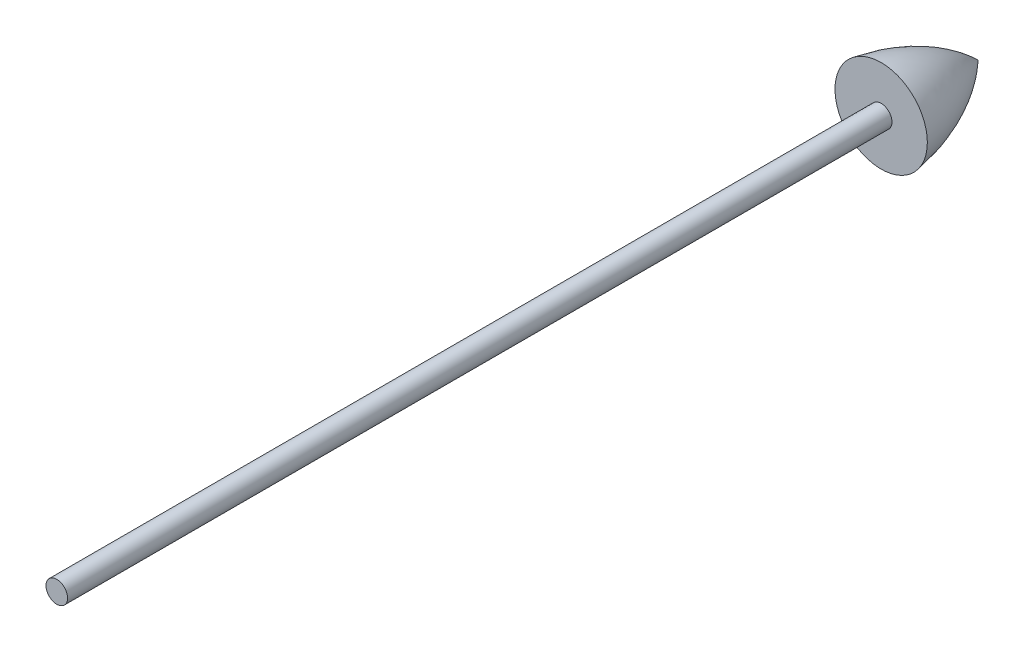
ISO-10303-21;
HEADER;
FILE_DESCRIPTION(('STEP AP214'),'2;1');
FILE_NAME('part.step','',(''),(''),'','','');
FILE_SCHEMA(('AUTOMOTIVE_DESIGN { 1 0 10303 214 1 1 1 1 }'));
ENDSEC;
DATA;
#1=APPLICATION_CONTEXT('core data for automotive mechanical design processes');
#2=APPLICATION_PROTOCOL_DEFINITION('international standard','automotive_design',2000,#1);
#3=PRODUCT_CONTEXT('',#1,'mechanical');
#4=PRODUCT('Part','Part','',(#3));
#5=PRODUCT_RELATED_PRODUCT_CATEGORY('part','',(#4));
#6=PRODUCT_DEFINITION_FORMATION('','',#4);
#7=PRODUCT_DEFINITION_CONTEXT('part definition',#1,'design');
#8=PRODUCT_DEFINITION('design','',#6,#7);
#9=PRODUCT_DEFINITION_SHAPE('','',#8);
#10=(LENGTH_UNIT() NAMED_UNIT(*) SI_UNIT(.MILLI.,.METRE.));
#11=(NAMED_UNIT(*) PLANE_ANGLE_UNIT() SI_UNIT($,.RADIAN.));
#12=(NAMED_UNIT(*) SI_UNIT($,.STERADIAN.) SOLID_ANGLE_UNIT());
#13=UNCERTAINTY_MEASURE_WITH_UNIT(LENGTH_MEASURE(1.E-05),#10,'distance_accuracy_value','');
#14=(GEOMETRIC_REPRESENTATION_CONTEXT(3) GLOBAL_UNCERTAINTY_ASSIGNED_CONTEXT((#13)) GLOBAL_UNIT_ASSIGNED_CONTEXT((#10,
#11,#12)) REPRESENTATION_CONTEXT('',''));
#15=CARTESIAN_POINT('',(0.,0.,0.));
#16=DIRECTION('',(0.,0.,1.));
#17=DIRECTION('',(1.,0.,0.));
#18=AXIS2_PLACEMENT_3D('',#15,#16,#17);
#19=CARTESIAN_POINT('',(0.,297.322506274806,-3633.24539596085));
#20=DIRECTION('',(0.,0.,1.));
#21=DIRECTION('',(1.,0.,0.));
#22=AXIS2_PLACEMENT_3D('',#19,#20,#21);
#23=PLANE('',#22);
#24=CARTESIAN_POINT('',(0.,262.437167268956,-3633.24539596085));
#25=DIRECTION('',(0.,0.,1.));
#26=DIRECTION('',(1.,0.,0.));
#27=AXIS2_PLACEMENT_3D('',#24,#25,#26);
#28=CIRCLE('',#27,149.062539166279);
#29=CARTESIAN_POINT('',(149.062539166279,262.437167268956,-3633.24539596085));
#30=VERTEX_POINT('',#29);
#31=EDGE_CURVE('E53',#30,#30,#28,.T.);
#32=ORIENTED_EDGE('',*,*,#31,.T.);
#33=EDGE_LOOP('',(#32));
#34=FACE_BOUND('',#33,.T.);
#35=CARTESIAN_POINT('',(0.,262.437167268956,-3633.24539596085));
#36=DIRECTION('',(0.,0.,1.));
#37=DIRECTION('',(1.,0.,0.));
#38=AXIS2_PLACEMENT_3D('',#35,#36,#37);
#39=CIRCLE('',#38,34.8853390058503);
#40=CARTESIAN_POINT('',(34.8853390058503,262.437167268956,-3633.24539596085));
#41=VERTEX_POINT('',#40);
#42=EDGE_CURVE('E11',#41,#41,#39,.T.);
#43=ORIENTED_EDGE('',*,*,#42,.F.);
#44=EDGE_LOOP('',(#43));
#45=FACE_BOUND('',#44,.T.);
#46=ADVANCED_FACE('F37',(#34,#45),#23,.T.);
#47=CARTESIAN_POINT('',(0.,262.437167268956,-1158.93168111609));
#48=DIRECTION('',(0.,0.,1.));
#49=DIRECTION('',(1.,0.,0.));
#50=AXIS2_PLACEMENT_3D('',#47,#48,#49);
#51=CYLINDRICAL_SURFACE('',#50,34.8853390058503);
#52=CARTESIAN_POINT('',(0.,262.437167268956,-971.847033356933));
#53=DIRECTION('',(0.,0.,1.));
#54=DIRECTION('',(1.,0.,0.));
#55=AXIS2_PLACEMENT_3D('',#52,#53,#54);
#56=CIRCLE('',#55,34.8853390058503);
#57=CARTESIAN_POINT('',(34.8853390058503,262.437167268956,-971.847033356933));
#58=VERTEX_POINT('',#57);
#59=EDGE_CURVE('E43',#58,#58,#56,.T.);
#60=ORIENTED_EDGE('',*,*,#59,.F.);
#61=EDGE_LOOP('',(#60));
#62=FACE_BOUND('',#61,.T.);
#63=ORIENTED_EDGE('',*,*,#42,.T.);
#64=EDGE_LOOP('',(#63));
#65=FACE_BOUND('',#64,.T.);
#66=ADVANCED_FACE('F66',(#62,#65),#51,.T.);
#67=CARTESIAN_POINT('',(0.,297.322506274806,-971.847033356933));
#68=DIRECTION('',(0.,0.,-1.));
#69=DIRECTION('',(-1.,0.,0.));
#70=AXIS2_PLACEMENT_3D('',#67,#68,#69);
#71=PLANE('',#70);
#72=ORIENTED_EDGE('',*,*,#59,.T.);
#73=EDGE_LOOP('',(#72));
#74=FACE_BOUND('',#73,.T.);
#75=ADVANCED_FACE('F49',(#74),#71,.F.);
#76=CARTESIAN_POINT('',(0.,411.499706435235,-3633.24539596085));
#77=CARTESIAN_POINT('',(0.,382.092840604886,-3821.74064038839));
#78=CARTESIAN_POINT('',(0.,262.437167268956,-3945.84299694561));
#79=B_SPLINE_CURVE_WITH_KNOTS('',2,(#76,#77,#78),.UNSPECIFIED.,.F.,.F.,(3,3),(0.,
0.920510374429221),.UNSPECIFIED.);
#80=CARTESIAN_POINT('',(0.,262.437167268956,-1158.93168111609));
#81=DIRECTION('',(0.,0.,1.));
#82=AXIS1_PLACEMENT('',#80,#81);
#83=SURFACE_OF_REVOLUTION('',#79,#82);
#84=CARTESIAN_POINT('',(0.,262.437167268956,-3945.84299694561));
#85=VERTEX_POINT('',#84);
#86=VERTEX_LOOP('',#85);
#87=FACE_BOUND('',#86,.T.);
#88=ORIENTED_EDGE('',*,*,#31,.F.);
#89=EDGE_LOOP('',(#88));
#90=FACE_BOUND('',#89,.T.);
#91=ADVANCED_FACE('F46',(#87,#90),#83,.F.);
#92=CLOSED_SHELL('',(#46,#66,#75,#91));
#93=MANIFOLD_SOLID_BREP('B2',#92);
#94=ADVANCED_BREP_SHAPE_REPRESENTATION('',(#18,#93),#14);
#95=SHAPE_DEFINITION_REPRESENTATION(#9,#94);
ENDSEC;
END-ISO-10303-21;
